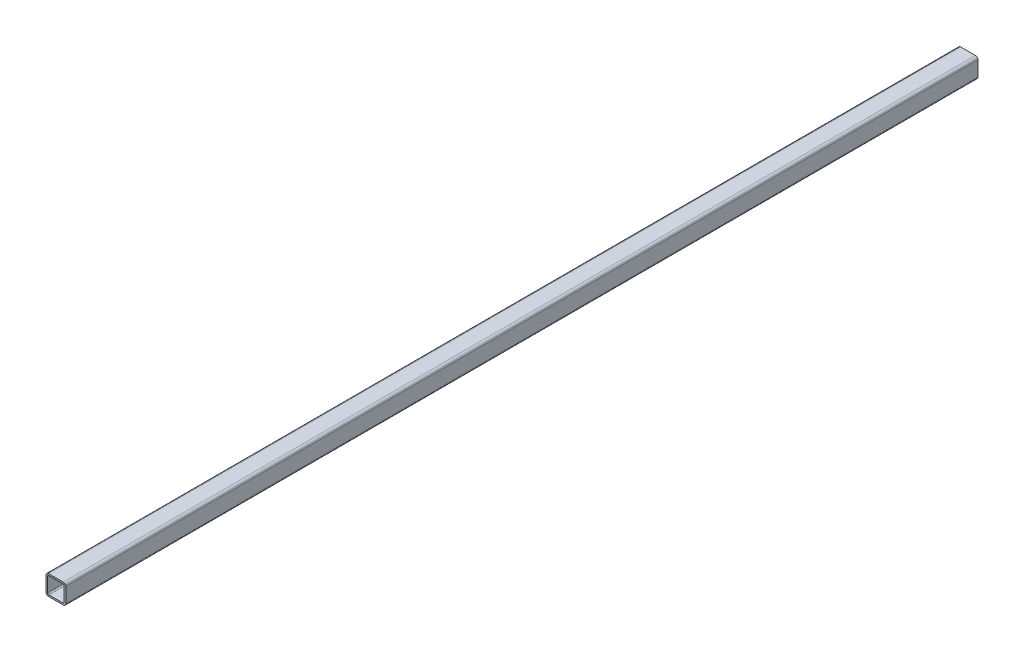
ISO-10303-21;
HEADER;
FILE_DESCRIPTION(('STEP AP214'),'2;1');
FILE_NAME('part.step','',(''),(''),'','','');
FILE_SCHEMA(('AUTOMOTIVE_DESIGN { 1 0 10303 214 1 1 1 1 }'));
ENDSEC;
DATA;
#1=APPLICATION_CONTEXT('core data for automotive mechanical design processes');
#2=APPLICATION_PROTOCOL_DEFINITION('international standard','automotive_design',2000,#1);
#3=PRODUCT_CONTEXT('',#1,'mechanical');
#4=PRODUCT('Part','Part','',(#3));
#5=PRODUCT_RELATED_PRODUCT_CATEGORY('part','',(#4));
#6=PRODUCT_DEFINITION_FORMATION('','',#4);
#7=PRODUCT_DEFINITION_CONTEXT('part definition',#1,'design');
#8=PRODUCT_DEFINITION('design','',#6,#7);
#9=PRODUCT_DEFINITION_SHAPE('','',#8);
#10=(LENGTH_UNIT() NAMED_UNIT(*) SI_UNIT(.MILLI.,.METRE.));
#11=(NAMED_UNIT(*) PLANE_ANGLE_UNIT() SI_UNIT($,.RADIAN.));
#12=(NAMED_UNIT(*) SI_UNIT($,.STERADIAN.) SOLID_ANGLE_UNIT());
#13=UNCERTAINTY_MEASURE_WITH_UNIT(LENGTH_MEASURE(1.E-05),#10,'distance_accuracy_value','');
#14=(GEOMETRIC_REPRESENTATION_CONTEXT(3) GLOBAL_UNCERTAINTY_ASSIGNED_CONTEXT((#13)) GLOBAL_UNIT_ASSIGNED_CONTEXT((#10,
#11,#12)) REPRESENTATION_CONTEXT('',''));
#15=CARTESIAN_POINT('',(0.,0.,0.));
#16=DIRECTION('',(0.,0.,1.));
#17=DIRECTION('',(1.,0.,0.));
#18=AXIS2_PLACEMENT_3D('',#15,#16,#17);
#19=CARTESIAN_POINT('',(0.,0.,609.6));
#20=DIRECTION('',(0.,0.,1.));
#21=DIRECTION('',(1.,0.,0.));
#22=AXIS2_PLACEMENT_3D('',#19,#20,#21);
#23=PLANE('',#22);
#24=DIRECTION('',(0.,-1.,0.));
#25=VECTOR('',#24,1.);
#26=CARTESIAN_POINT('',(-12.7,-12.7,609.6));
#27=LINE('',#26,#25);
#28=CARTESIAN_POINT('',(-12.7,9.525,609.6));
#29=VERTEX_POINT('',#28);
#30=CARTESIAN_POINT('',(-12.7,-9.525,609.6));
#31=VERTEX_POINT('',#30);
#32=EDGE_CURVE('E299',#29,#31,#27,.T.);
#33=ORIENTED_EDGE('',*,*,#32,.T.);
#34=CARTESIAN_POINT('',(-9.525,-9.525,609.6));
#35=DIRECTION('',(0.,0.,1.));
#36=DIRECTION('',(1.,0.,0.));
#37=AXIS2_PLACEMENT_3D('',#34,#35,#36);
#38=CIRCLE('',#37,3.175);
#39=CARTESIAN_POINT('',(-9.525,-12.7,609.6));
#40=VERTEX_POINT('',#39);
#41=EDGE_CURVE('E328',#31,#40,#38,.T.);
#42=ORIENTED_EDGE('',*,*,#41,.T.);
#43=DIRECTION('',(1.,0.,0.));
#44=VECTOR('',#43,1.);
#45=CARTESIAN_POINT('',(12.7,-12.7,609.6));
#46=LINE('',#45,#44);
#47=CARTESIAN_POINT('',(9.525,-12.7,609.6));
#48=VERTEX_POINT('',#47);
#49=EDGE_CURVE('E303',#40,#48,#46,.T.);
#50=ORIENTED_EDGE('',*,*,#49,.T.);
#51=CARTESIAN_POINT('',(9.525,-9.525,609.6));
#52=DIRECTION('',(0.,0.,1.));
#53=DIRECTION('',(1.,0.,0.));
#54=AXIS2_PLACEMENT_3D('',#51,#52,#53);
#55=CIRCLE('',#54,3.175);
#56=CARTESIAN_POINT('',(12.7,-9.525,609.6));
#57=VERTEX_POINT('',#56);
#58=EDGE_CURVE('E325',#48,#57,#55,.T.);
#59=ORIENTED_EDGE('',*,*,#58,.T.);
#60=DIRECTION('',(0.,1.,0.));
#61=VECTOR('',#60,1.);
#62=CARTESIAN_POINT('',(12.7,-12.7,609.6));
#63=LINE('',#62,#61);
#64=CARTESIAN_POINT('',(12.7,9.525,609.6));
#65=VERTEX_POINT('',#64);
#66=EDGE_CURVE('E292',#57,#65,#63,.T.);
#67=ORIENTED_EDGE('',*,*,#66,.T.);
#68=CARTESIAN_POINT('',(9.525,9.525,609.6));
#69=DIRECTION('',(0.,0.,1.));
#70=DIRECTION('',(1.,0.,0.));
#71=AXIS2_PLACEMENT_3D('',#68,#69,#70);
#72=CIRCLE('',#71,3.175);
#73=CARTESIAN_POINT('',(9.525,12.7,609.6));
#74=VERTEX_POINT('',#73);
#75=EDGE_CURVE('E320',#65,#74,#72,.T.);
#76=ORIENTED_EDGE('',*,*,#75,.T.);
#77=DIRECTION('',(-1.,0.,0.));
#78=VECTOR('',#77,1.);
#79=CARTESIAN_POINT('',(12.7,12.7,609.6));
#80=LINE('',#79,#78);
#81=CARTESIAN_POINT('',(-9.525,12.7,609.6));
#82=VERTEX_POINT('',#81);
#83=EDGE_CURVE('E296',#74,#82,#80,.T.);
#84=ORIENTED_EDGE('',*,*,#83,.T.);
#85=CARTESIAN_POINT('',(-9.525,9.525,609.6));
#86=DIRECTION('',(0.,0.,1.));
#87=DIRECTION('',(1.,0.,0.));
#88=AXIS2_PLACEMENT_3D('',#85,#86,#87);
#89=CIRCLE('',#88,3.175);
#90=EDGE_CURVE('E180',#82,#29,#89,.T.);
#91=ORIENTED_EDGE('',*,*,#90,.T.);
#92=EDGE_LOOP('',(#33,#42,#50,#59,#67,#76,#84,#91));
#93=FACE_BOUND('',#92,.T.);
#94=DIRECTION('',(-1.,0.,0.));
#95=VECTOR('',#94,1.);
#96=CARTESIAN_POINT('',(10.668,10.668,609.6));
#97=LINE('',#96,#95);
#98=CARTESIAN_POINT('',(9.0805,10.668,609.6));
#99=VERTEX_POINT('',#98);
#100=CARTESIAN_POINT('',(-9.0805,10.668,609.6));
#101=VERTEX_POINT('',#100);
#102=EDGE_CURVE('E230',#99,#101,#97,.T.);
#103=ORIENTED_EDGE('',*,*,#102,.F.);
#104=CARTESIAN_POINT('',(9.0805,9.0805,609.6));
#105=DIRECTION('',(0.,0.,1.));
#106=DIRECTION('',(1.,0.,0.));
#107=AXIS2_PLACEMENT_3D('',#104,#105,#106);
#108=CIRCLE('',#107,1.5875);
#109=CARTESIAN_POINT('',(10.668,9.0805,609.6));
#110=VERTEX_POINT('',#109);
#111=EDGE_CURVE('E219',#99,#110,#108,.F.);
#112=ORIENTED_EDGE('',*,*,#111,.T.);
#113=DIRECTION('',(0.,1.,0.));
#114=VECTOR('',#113,1.);
#115=CARTESIAN_POINT('',(10.668,-10.668,609.6));
#116=LINE('',#115,#114);
#117=CARTESIAN_POINT('',(10.668,-9.0805,609.6));
#118=VERTEX_POINT('',#117);
#119=EDGE_CURVE('E241',#118,#110,#116,.T.);
#120=ORIENTED_EDGE('',*,*,#119,.F.);
#121=CARTESIAN_POINT('',(9.0805,-9.0805,609.6));
#122=DIRECTION('',(0.,0.,1.));
#123=DIRECTION('',(1.,0.,0.));
#124=AXIS2_PLACEMENT_3D('',#121,#122,#123);
#125=CIRCLE('',#124,1.5875);
#126=CARTESIAN_POINT('',(9.0805,-10.668,609.6));
#127=VERTEX_POINT('',#126);
#128=EDGE_CURVE('E216',#118,#127,#125,.F.);
#129=ORIENTED_EDGE('',*,*,#128,.T.);
#130=DIRECTION('',(1.,0.,0.));
#131=VECTOR('',#130,1.);
#132=CARTESIAN_POINT('',(10.668,-10.668,609.6));
#133=LINE('',#132,#131);
#134=CARTESIAN_POINT('',(-9.0805,-10.668,609.6));
#135=VERTEX_POINT('',#134);
#136=EDGE_CURVE('E288',#135,#127,#133,.T.);
#137=ORIENTED_EDGE('',*,*,#136,.F.);
#138=CARTESIAN_POINT('',(-9.0805,-9.0805,609.6));
#139=DIRECTION('',(0.,0.,1.));
#140=DIRECTION('',(1.,0.,0.));
#141=AXIS2_PLACEMENT_3D('',#138,#139,#140);
#142=CIRCLE('',#141,1.5875);
#143=CARTESIAN_POINT('',(-10.668,-9.0805,609.6));
#144=VERTEX_POINT('',#143);
#145=EDGE_CURVE('E222',#135,#144,#142,.F.);
#146=ORIENTED_EDGE('',*,*,#145,.T.);
#147=DIRECTION('',(0.,-1.,0.));
#148=VECTOR('',#147,1.);
#149=CARTESIAN_POINT('',(-10.668,-10.668,609.6));
#150=LINE('',#149,#148);
#151=CARTESIAN_POINT('',(-10.668,9.0805,609.6));
#152=VERTEX_POINT('',#151);
#153=EDGE_CURVE('E233',#152,#144,#150,.T.);
#154=ORIENTED_EDGE('',*,*,#153,.F.);
#155=CARTESIAN_POINT('',(-9.0805,9.0805,609.6));
#156=DIRECTION('',(0.,0.,1.));
#157=DIRECTION('',(1.,0.,0.));
#158=AXIS2_PLACEMENT_3D('',#155,#156,#157);
#159=CIRCLE('',#158,1.5875);
#160=EDGE_CURVE('E53',#152,#101,#159,.F.);
#161=ORIENTED_EDGE('',*,*,#160,.T.);
#162=EDGE_LOOP('',(#103,#112,#120,#129,#137,#146,#154,#161));
#163=FACE_BOUND('',#162,.T.);
#164=ADVANCED_FACE('F44',(#93,#163),#23,.T.);
#165=CARTESIAN_POINT('',(12.7,-12.7,609.6));
#166=DIRECTION('',(-1.,0.,0.));
#167=DIRECTION('',(0.,-1.,0.));
#168=AXIS2_PLACEMENT_3D('',#165,#166,#167);
#169=PLANE('',#168);
#170=DIRECTION('',(0.,0.,-1.));
#171=VECTOR('',#170,1.);
#172=CARTESIAN_POINT('',(12.7,-9.525,609.6));
#173=LINE('',#172,#171);
#174=CARTESIAN_POINT('',(12.7,-9.525,-558.8));
#175=VERTEX_POINT('',#174);
#176=EDGE_CURVE('E188',#57,#175,#173,.T.);
#177=ORIENTED_EDGE('',*,*,#176,.T.);
#178=DIRECTION('',(0.,1.,0.));
#179=VECTOR('',#178,1.);
#180=CARTESIAN_POINT('',(12.7,-12.7,-558.8));
#181=LINE('',#180,#179);
#182=CARTESIAN_POINT('',(12.7,9.525,-558.8));
#183=VERTEX_POINT('',#182);
#184=EDGE_CURVE('E250',#175,#183,#181,.T.);
#185=ORIENTED_EDGE('',*,*,#184,.T.);
#186=DIRECTION('',(0.,0.,-1.));
#187=VECTOR('',#186,1.);
#188=CARTESIAN_POINT('',(12.7,9.525,609.6));
#189=LINE('',#188,#187);
#190=EDGE_CURVE('E331',#183,#65,#189,.F.);
#191=ORIENTED_EDGE('',*,*,#190,.T.);
#192=ORIENTED_EDGE('',*,*,#66,.F.);
#193=EDGE_LOOP('',(#177,#185,#191,#192));
#194=FACE_BOUND('',#193,.T.);
#195=ADVANCED_FACE('F338',(#194),#169,.F.);
#196=CARTESIAN_POINT('',(12.7,12.7,609.6));
#197=DIRECTION('',(0.,-1.,0.));
#198=DIRECTION('',(1.,0.,0.));
#199=AXIS2_PLACEMENT_3D('',#196,#197,#198);
#200=PLANE('',#199);
#201=DIRECTION('',(0.,0.,-1.));
#202=VECTOR('',#201,1.);
#203=CARTESIAN_POINT('',(9.525,12.7,609.6));
#204=LINE('',#203,#202);
#205=CARTESIAN_POINT('',(9.525,12.7,-558.8));
#206=VERTEX_POINT('',#205);
#207=EDGE_CURVE('E174',#74,#206,#204,.T.);
#208=ORIENTED_EDGE('',*,*,#207,.T.);
#209=DIRECTION('',(1.,0.,0.));
#210=VECTOR('',#209,1.);
#211=CARTESIAN_POINT('',(-12.7,12.7,-558.8));
#212=LINE('',#211,#210);
#213=CARTESIAN_POINT('',(-9.525,12.7,-558.8));
#214=VERTEX_POINT('',#213);
#215=EDGE_CURVE('E60',#214,#206,#212,.T.);
#216=ORIENTED_EDGE('',*,*,#215,.F.);
#217=DIRECTION('',(0.,0.,-1.));
#218=VECTOR('',#217,1.);
#219=CARTESIAN_POINT('',(-9.525,12.7,609.6));
#220=LINE('',#219,#218);
#221=EDGE_CURVE('E171',#214,#82,#220,.F.);
#222=ORIENTED_EDGE('',*,*,#221,.T.);
#223=ORIENTED_EDGE('',*,*,#83,.F.);
#224=EDGE_LOOP('',(#208,#216,#222,#223));
#225=FACE_BOUND('',#224,.T.);
#226=ADVANCED_FACE('F169',(#225),#200,.F.);
#227=CARTESIAN_POINT('',(-12.7,-12.7,609.6));
#228=DIRECTION('',(1.,0.,0.));
#229=DIRECTION('',(0.,0.,-1.));
#230=AXIS2_PLACEMENT_3D('',#227,#228,#229);
#231=PLANE('',#230);
#232=DIRECTION('',(0.,0.,-1.));
#233=VECTOR('',#232,1.);
#234=CARTESIAN_POINT('',(-12.7,9.525,609.6));
#235=LINE('',#234,#233);
#236=CARTESIAN_POINT('',(-12.7,9.525,-558.8));
#237=VERTEX_POINT('',#236);
#238=EDGE_CURVE('E314',#29,#237,#235,.T.);
#239=ORIENTED_EDGE('',*,*,#238,.T.);
#240=DIRECTION('',(0.,1.,0.));
#241=VECTOR('',#240,1.);
#242=CARTESIAN_POINT('',(-12.7,-12.7,-558.8));
#243=LINE('',#242,#241);
#244=CARTESIAN_POINT('',(-12.7,-9.525,-558.8));
#245=VERTEX_POINT('',#244);
#246=EDGE_CURVE('E158',#245,#237,#243,.T.);
#247=ORIENTED_EDGE('',*,*,#246,.F.);
#248=DIRECTION('',(0.,0.,-1.));
#249=VECTOR('',#248,1.);
#250=CARTESIAN_POINT('',(-12.7,-9.525,609.6));
#251=LINE('',#250,#249);
#252=EDGE_CURVE('E317',#245,#31,#251,.F.);
#253=ORIENTED_EDGE('',*,*,#252,.T.);
#254=ORIENTED_EDGE('',*,*,#32,.F.);
#255=EDGE_LOOP('',(#239,#247,#253,#254));
#256=FACE_BOUND('',#255,.T.);
#257=ADVANCED_FACE('F359',(#256),#231,.F.);
#258=CARTESIAN_POINT('',(12.7,-12.7,609.6));
#259=DIRECTION('',(0.,1.,0.));
#260=DIRECTION('',(-1.,0.,0.));
#261=AXIS2_PLACEMENT_3D('',#258,#259,#260);
#262=PLANE('',#261);
#263=DIRECTION('',(0.,0.,-1.));
#264=VECTOR('',#263,1.);
#265=CARTESIAN_POINT('',(-9.525,-12.7,609.6));
#266=LINE('',#265,#264);
#267=CARTESIAN_POINT('',(-9.525,-12.7,-558.8));
#268=VERTEX_POINT('',#267);
#269=EDGE_CURVE('E310',#40,#268,#266,.T.);
#270=ORIENTED_EDGE('',*,*,#269,.T.);
#271=DIRECTION('',(1.,0.,0.));
#272=VECTOR('',#271,1.);
#273=CARTESIAN_POINT('',(-12.7,-12.7,-558.8));
#274=LINE('',#273,#272);
#275=CARTESIAN_POINT('',(9.52499999999999,-12.7,-558.8));
#276=VERTEX_POINT('',#275);
#277=EDGE_CURVE('E176',#268,#276,#274,.T.);
#278=ORIENTED_EDGE('',*,*,#277,.T.);
#279=DIRECTION('',(0.,0.,-1.));
#280=VECTOR('',#279,1.);
#281=CARTESIAN_POINT('',(9.525,-12.7,609.6));
#282=LINE('',#281,#280);
#283=EDGE_CURVE('E307',#276,#48,#282,.F.);
#284=ORIENTED_EDGE('',*,*,#283,.T.);
#285=ORIENTED_EDGE('',*,*,#49,.F.);
#286=EDGE_LOOP('',(#270,#278,#284,#285));
#287=FACE_BOUND('',#286,.T.);
#288=ADVANCED_FACE('F348',(#287),#262,.F.);
#289=CARTESIAN_POINT('',(10.668,-10.668,609.6));
#290=DIRECTION('',(-1.,0.,0.));
#291=DIRECTION('',(0.,0.,1.));
#292=AXIS2_PLACEMENT_3D('',#289,#290,#291);
#293=PLANE('',#292);
#294=DIRECTION('',(0.,1.,0.));
#295=VECTOR('',#294,1.);
#296=CARTESIAN_POINT('',(10.668,-10.668,-558.8));
#297=LINE('',#296,#295);
#298=CARTESIAN_POINT('',(10.668,-9.0805,-558.8));
#299=VERTEX_POINT('',#298);
#300=CARTESIAN_POINT('',(10.668,9.0805,-558.8));
#301=VERTEX_POINT('',#300);
#302=EDGE_CURVE('E269',#299,#301,#297,.T.);
#303=ORIENTED_EDGE('',*,*,#302,.F.);
#304=DIRECTION('',(0.,0.,-1.));
#305=VECTOR('',#304,1.);
#306=CARTESIAN_POINT('',(10.668,-9.0805,609.6));
#307=LINE('',#306,#305);
#308=EDGE_CURVE('E199',#299,#118,#307,.F.);
#309=ORIENTED_EDGE('',*,*,#308,.T.);
#310=ORIENTED_EDGE('',*,*,#119,.T.);
#311=DIRECTION('',(0.,0.,-1.));
#312=VECTOR('',#311,1.);
#313=CARTESIAN_POINT('',(10.668,9.0805,-609.6));
#314=LINE('',#313,#312);
#315=EDGE_CURVE('E195',#110,#301,#314,.T.);
#316=ORIENTED_EDGE('',*,*,#315,.T.);
#317=EDGE_LOOP('',(#303,#309,#310,#316));
#318=FACE_BOUND('',#317,.T.);
#319=ADVANCED_FACE('F385',(#318),#293,.T.);
#320=CARTESIAN_POINT('',(10.668,10.668,609.6));
#321=DIRECTION('',(0.,-1.,0.));
#322=DIRECTION('',(1.,0.,0.));
#323=AXIS2_PLACEMENT_3D('',#320,#321,#322);
#324=PLANE('',#323);
#325=DIRECTION('',(-1.,0.,0.));
#326=VECTOR('',#325,1.);
#327=CARTESIAN_POINT('',(10.668,10.668,-558.8));
#328=LINE('',#327,#326);
#329=CARTESIAN_POINT('',(9.0805,10.668,-558.8));
#330=VERTEX_POINT('',#329);
#331=CARTESIAN_POINT('',(-9.0805,10.668,-558.8));
#332=VERTEX_POINT('',#331);
#333=EDGE_CURVE('E68',#330,#332,#328,.T.);
#334=ORIENTED_EDGE('',*,*,#333,.F.);
#335=DIRECTION('',(0.,0.,-1.));
#336=VECTOR('',#335,1.);
#337=CARTESIAN_POINT('',(9.0805,10.668,609.6));
#338=LINE('',#337,#336);
#339=EDGE_CURVE('E206',#330,#99,#338,.F.);
#340=ORIENTED_EDGE('',*,*,#339,.T.);
#341=ORIENTED_EDGE('',*,*,#102,.T.);
#342=DIRECTION('',(0.,0.,-1.));
#343=VECTOR('',#342,1.);
#344=CARTESIAN_POINT('',(-9.0805,10.668,-609.6));
#345=LINE('',#344,#343);
#346=EDGE_CURVE('E202',#101,#332,#345,.T.);
#347=ORIENTED_EDGE('',*,*,#346,.T.);
#348=EDGE_LOOP('',(#334,#340,#341,#347));
#349=FACE_BOUND('',#348,.T.);
#350=ADVANCED_FACE('F238',(#349),#324,.T.);
#351=CARTESIAN_POINT('',(-10.668,-10.668,609.6));
#352=DIRECTION('',(1.,0.,0.));
#353=DIRECTION('',(0.,0.,-1.));
#354=AXIS2_PLACEMENT_3D('',#351,#352,#353);
#355=PLANE('',#354);
#356=DIRECTION('',(0.,-1.,0.));
#357=VECTOR('',#356,1.);
#358=CARTESIAN_POINT('',(-10.668,-10.668,-558.8));
#359=LINE('',#358,#357);
#360=CARTESIAN_POINT('',(-10.668,9.0805,-558.8));
#361=VERTEX_POINT('',#360);
#362=CARTESIAN_POINT('',(-10.668,-9.0805,-558.8));
#363=VERTEX_POINT('',#362);
#364=EDGE_CURVE('E244',#361,#363,#359,.T.);
#365=ORIENTED_EDGE('',*,*,#364,.F.);
#366=DIRECTION('',(0.,0.,-1.));
#367=VECTOR('',#366,1.);
#368=CARTESIAN_POINT('',(-10.668,9.0805,609.6));
#369=LINE('',#368,#367);
#370=EDGE_CURVE('E209',#361,#152,#369,.F.);
#371=ORIENTED_EDGE('',*,*,#370,.T.);
#372=ORIENTED_EDGE('',*,*,#153,.T.);
#373=DIRECTION('',(0.,0.,-1.));
#374=VECTOR('',#373,1.);
#375=CARTESIAN_POINT('',(-10.668,-9.0805,-609.6));
#376=LINE('',#375,#374);
#377=EDGE_CURVE('E212',#144,#363,#376,.T.);
#378=ORIENTED_EDGE('',*,*,#377,.T.);
#379=EDGE_LOOP('',(#365,#371,#372,#378));
#380=FACE_BOUND('',#379,.T.);
#381=ADVANCED_FACE('F247',(#380),#355,.T.);
#382=CARTESIAN_POINT('',(10.668,-10.668,609.6));
#383=DIRECTION('',(0.,1.,0.));
#384=DIRECTION('',(-1.,0.,0.));
#385=AXIS2_PLACEMENT_3D('',#382,#383,#384);
#386=PLANE('',#385);
#387=DIRECTION('',(1.,0.,0.));
#388=VECTOR('',#387,1.);
#389=CARTESIAN_POINT('',(10.668,-10.668,-558.8));
#390=LINE('',#389,#388);
#391=CARTESIAN_POINT('',(-9.0805,-10.668,-558.8));
#392=VERTEX_POINT('',#391);
#393=CARTESIAN_POINT('',(9.0805,-10.668,-558.8));
#394=VERTEX_POINT('',#393);
#395=EDGE_CURVE('E266',#392,#394,#390,.T.);
#396=ORIENTED_EDGE('',*,*,#395,.F.);
#397=DIRECTION('',(0.,0.,-1.));
#398=VECTOR('',#397,1.);
#399=CARTESIAN_POINT('',(-9.0805,-10.668,609.6));
#400=LINE('',#399,#398);
#401=EDGE_CURVE('E182',#392,#135,#400,.F.);
#402=ORIENTED_EDGE('',*,*,#401,.T.);
#403=ORIENTED_EDGE('',*,*,#136,.T.);
#404=DIRECTION('',(0.,0.,-1.));
#405=VECTOR('',#404,1.);
#406=CARTESIAN_POINT('',(9.0805,-10.668,-609.6));
#407=LINE('',#406,#405);
#408=EDGE_CURVE('E186',#127,#394,#407,.T.);
#409=ORIENTED_EDGE('',*,*,#408,.T.);
#410=EDGE_LOOP('',(#396,#402,#403,#409));
#411=FACE_BOUND('',#410,.T.);
#412=ADVANCED_FACE('F395',(#411),#386,.T.);
#413=CARTESIAN_POINT('',(-9.525,-9.525,609.6));
#414=DIRECTION('',(0.,0.,-1.));
#415=DIRECTION('',(-1.,0.,0.));
#416=AXIS2_PLACEMENT_3D('',#413,#414,#415);
#417=CYLINDRICAL_SURFACE('',#416,3.175);
#418=CARTESIAN_POINT('',(-9.525,-9.525,-558.8));
#419=DIRECTION('',(0.,0.,1.));
#420=DIRECTION('',(1.,0.,0.));
#421=AXIS2_PLACEMENT_3D('',#418,#419,#420);
#422=CIRCLE('',#421,3.175);
#423=EDGE_CURVE('E280',#268,#245,#422,.F.);
#424=ORIENTED_EDGE('',*,*,#423,.F.);
#425=ORIENTED_EDGE('',*,*,#269,.F.);
#426=ORIENTED_EDGE('',*,*,#41,.F.);
#427=ORIENTED_EDGE('',*,*,#252,.F.);
#428=EDGE_LOOP('',(#424,#425,#426,#427));
#429=FACE_BOUND('',#428,.T.);
#430=ADVANCED_FACE('F356',(#429),#417,.T.);
#431=CARTESIAN_POINT('',(9.525,-9.525,609.6));
#432=DIRECTION('',(0.,0.,-1.));
#433=DIRECTION('',(-1.,0.,0.));
#434=AXIS2_PLACEMENT_3D('',#431,#432,#433);
#435=CYLINDRICAL_SURFACE('',#434,3.175);
#436=CARTESIAN_POINT('',(9.525,-9.525,-558.8));
#437=DIRECTION('',(0.,0.,1.));
#438=DIRECTION('',(1.,0.,0.));
#439=AXIS2_PLACEMENT_3D('',#436,#437,#438);
#440=CIRCLE('',#439,3.175);
#441=EDGE_CURVE('E164',#175,#276,#440,.F.);
#442=ORIENTED_EDGE('',*,*,#441,.F.);
#443=ORIENTED_EDGE('',*,*,#176,.F.);
#444=ORIENTED_EDGE('',*,*,#58,.F.);
#445=ORIENTED_EDGE('',*,*,#283,.F.);
#446=EDGE_LOOP('',(#442,#443,#444,#445));
#447=FACE_BOUND('',#446,.T.);
#448=ADVANCED_FACE('F343',(#447),#435,.T.);
#449=CARTESIAN_POINT('',(-9.525,9.525,609.6));
#450=DIRECTION('',(0.,0.,-1.));
#451=DIRECTION('',(-1.,0.,0.));
#452=AXIS2_PLACEMENT_3D('',#449,#450,#451);
#453=CYLINDRICAL_SURFACE('',#452,3.175);
#454=CARTESIAN_POINT('',(-9.525,9.525,-558.8));
#455=DIRECTION('',(0.,0.,1.));
#456=DIRECTION('',(1.,0.,0.));
#457=AXIS2_PLACEMENT_3D('',#454,#455,#456);
#458=CIRCLE('',#457,3.175);
#459=EDGE_CURVE('E155',#237,#214,#458,.F.);
#460=ORIENTED_EDGE('',*,*,#459,.F.);
#461=ORIENTED_EDGE('',*,*,#238,.F.);
#462=ORIENTED_EDGE('',*,*,#90,.F.);
#463=ORIENTED_EDGE('',*,*,#221,.F.);
#464=EDGE_LOOP('',(#460,#461,#462,#463));
#465=FACE_BOUND('',#464,.T.);
#466=ADVANCED_FACE('F179',(#465),#453,.T.);
#467=CARTESIAN_POINT('',(9.525,9.525,609.6));
#468=DIRECTION('',(0.,0.,-1.));
#469=DIRECTION('',(-1.,0.,0.));
#470=AXIS2_PLACEMENT_3D('',#467,#468,#469);
#471=CYLINDRICAL_SURFACE('',#470,3.175);
#472=CARTESIAN_POINT('',(9.525,9.525,-558.8));
#473=DIRECTION('',(0.,0.,1.));
#474=DIRECTION('',(1.,0.,0.));
#475=AXIS2_PLACEMENT_3D('',#472,#473,#474);
#476=CIRCLE('',#475,3.175);
#477=EDGE_CURVE('E165',#206,#183,#476,.F.);
#478=ORIENTED_EDGE('',*,*,#477,.F.);
#479=ORIENTED_EDGE('',*,*,#207,.F.);
#480=ORIENTED_EDGE('',*,*,#75,.F.);
#481=ORIENTED_EDGE('',*,*,#190,.F.);
#482=EDGE_LOOP('',(#478,#479,#480,#481));
#483=FACE_BOUND('',#482,.T.);
#484=ADVANCED_FACE('F364',(#483),#471,.T.);
#485=CARTESIAN_POINT('',(9.0805,-9.0805,609.6));
#486=DIRECTION('',(0.,0.,1.));
#487=DIRECTION('',(1.,0.,0.));
#488=AXIS2_PLACEMENT_3D('',#485,#486,#487);
#489=CYLINDRICAL_SURFACE('',#488,1.5875);
#490=ORIENTED_EDGE('',*,*,#308,.F.);
#491=CARTESIAN_POINT('',(9.0805,-9.0805,-558.8));
#492=DIRECTION('',(0.,0.,1.));
#493=DIRECTION('',(1.,0.,0.));
#494=AXIS2_PLACEMENT_3D('',#491,#492,#493);
#495=CIRCLE('',#494,1.5875);
#496=EDGE_CURVE('E272',#299,#394,#495,.F.);
#497=ORIENTED_EDGE('',*,*,#496,.T.);
#498=ORIENTED_EDGE('',*,*,#408,.F.);
#499=ORIENTED_EDGE('',*,*,#128,.F.);
#500=EDGE_LOOP('',(#490,#497,#498,#499));
#501=FACE_BOUND('',#500,.T.);
#502=ADVANCED_FACE('F366',(#501),#489,.F.);
#503=CARTESIAN_POINT('',(9.0805,9.0805,609.6));
#504=DIRECTION('',(0.,0.,1.));
#505=DIRECTION('',(1.,0.,0.));
#506=AXIS2_PLACEMENT_3D('',#503,#504,#505);
#507=CYLINDRICAL_SURFACE('',#506,1.5875);
#508=ORIENTED_EDGE('',*,*,#339,.F.);
#509=CARTESIAN_POINT('',(9.0805,9.0805,-558.8));
#510=DIRECTION('',(0.,0.,1.));
#511=DIRECTION('',(1.,0.,0.));
#512=AXIS2_PLACEMENT_3D('',#509,#510,#511);
#513=CIRCLE('',#512,1.5875);
#514=EDGE_CURVE('E262',#330,#301,#513,.F.);
#515=ORIENTED_EDGE('',*,*,#514,.T.);
#516=ORIENTED_EDGE('',*,*,#315,.F.);
#517=ORIENTED_EDGE('',*,*,#111,.F.);
#518=EDGE_LOOP('',(#508,#515,#516,#517));
#519=FACE_BOUND('',#518,.T.);
#520=ADVANCED_FACE('F372',(#519),#507,.F.);
#521=CARTESIAN_POINT('',(-9.0805,-9.0805,609.6));
#522=DIRECTION('',(0.,0.,1.));
#523=DIRECTION('',(1.,0.,0.));
#524=AXIS2_PLACEMENT_3D('',#521,#522,#523);
#525=CYLINDRICAL_SURFACE('',#524,1.5875);
#526=ORIENTED_EDGE('',*,*,#401,.F.);
#527=CARTESIAN_POINT('',(-9.0805,-9.0805,-558.8));
#528=DIRECTION('',(0.,0.,1.));
#529=DIRECTION('',(1.,0.,0.));
#530=AXIS2_PLACEMENT_3D('',#527,#528,#529);
#531=CIRCLE('',#530,1.5875);
#532=EDGE_CURVE('E254',#392,#363,#531,.F.);
#533=ORIENTED_EDGE('',*,*,#532,.T.);
#534=ORIENTED_EDGE('',*,*,#377,.F.);
#535=ORIENTED_EDGE('',*,*,#145,.F.);
#536=EDGE_LOOP('',(#526,#533,#534,#535));
#537=FACE_BOUND('',#536,.T.);
#538=ADVANCED_FACE('F426',(#537),#525,.F.);
#539=CARTESIAN_POINT('',(-9.0805,9.0805,609.6));
#540=DIRECTION('',(0.,0.,1.));
#541=DIRECTION('',(1.,0.,0.));
#542=AXIS2_PLACEMENT_3D('',#539,#540,#541);
#543=CYLINDRICAL_SURFACE('',#542,1.5875);
#544=ORIENTED_EDGE('',*,*,#370,.F.);
#545=CARTESIAN_POINT('',(-9.0805,9.0805,-558.8));
#546=DIRECTION('',(0.,0.,1.));
#547=DIRECTION('',(1.,0.,0.));
#548=AXIS2_PLACEMENT_3D('',#545,#546,#547);
#549=CIRCLE('',#548,1.5875);
#550=EDGE_CURVE('E11',#361,#332,#549,.F.);
#551=ORIENTED_EDGE('',*,*,#550,.T.);
#552=ORIENTED_EDGE('',*,*,#346,.F.);
#553=ORIENTED_EDGE('',*,*,#160,.F.);
#554=EDGE_LOOP('',(#544,#551,#552,#553));
#555=FACE_BOUND('',#554,.T.);
#556=ADVANCED_FACE('F46',(#555),#543,.F.);
#557=CARTESIAN_POINT('',(-12.7,-12.7,-558.8));
#558=DIRECTION('',(0.,0.,1.));
#559=DIRECTION('',(1.,0.,0.));
#560=AXIS2_PLACEMENT_3D('',#557,#558,#559);
#561=PLANE('',#560);
#562=ORIENTED_EDGE('',*,*,#423,.T.);
#563=ORIENTED_EDGE('',*,*,#246,.T.);
#564=ORIENTED_EDGE('',*,*,#459,.T.);
#565=ORIENTED_EDGE('',*,*,#215,.T.);
#566=ORIENTED_EDGE('',*,*,#477,.T.);
#567=ORIENTED_EDGE('',*,*,#184,.F.);
#568=ORIENTED_EDGE('',*,*,#441,.T.);
#569=ORIENTED_EDGE('',*,*,#277,.F.);
#570=EDGE_LOOP('',(#562,#563,#564,#565,#566,#567,#568,#569));
#571=FACE_BOUND('',#570,.T.);
#572=ORIENTED_EDGE('',*,*,#302,.T.);
#573=ORIENTED_EDGE('',*,*,#514,.F.);
#574=ORIENTED_EDGE('',*,*,#333,.T.);
#575=ORIENTED_EDGE('',*,*,#550,.F.);
#576=ORIENTED_EDGE('',*,*,#364,.T.);
#577=ORIENTED_EDGE('',*,*,#532,.F.);
#578=ORIENTED_EDGE('',*,*,#395,.T.);
#579=ORIENTED_EDGE('',*,*,#496,.F.);
#580=EDGE_LOOP('',(#572,#573,#574,#575,#576,#577,#578,#579));
#581=FACE_BOUND('',#580,.T.);
#582=ADVANCED_FACE('F156',(#571,#581),#561,.F.);
#583=CLOSED_SHELL('',(#164,#195,#226,#257,#288,#319,#350,#381,#412,#430,#448,#466,#484,#502,
#520,#538,#556,#582));
#584=MANIFOLD_SOLID_BREP('B2',#583);
#585=ADVANCED_BREP_SHAPE_REPRESENTATION('',(#18,#584),#14);
#586=SHAPE_DEFINITION_REPRESENTATION(#9,#585);
ENDSEC;
END-ISO-10303-21;
